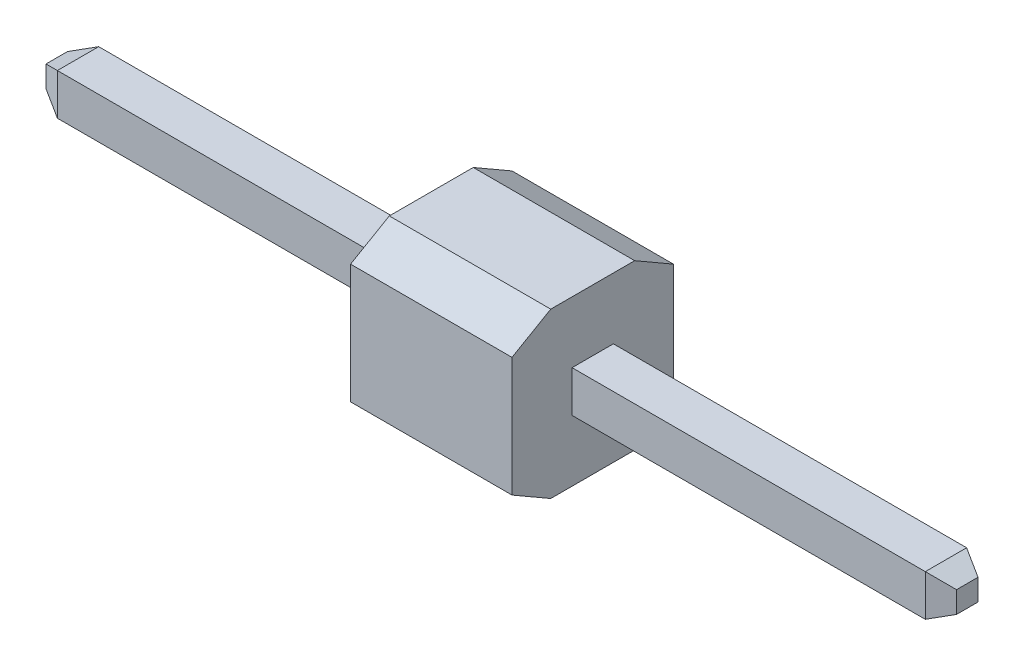
ISO-10303-21;
HEADER;
FILE_DESCRIPTION(('STEP AP214'),'2;1');
FILE_NAME('part.step','',(''),(''),'','','');
FILE_SCHEMA(('AUTOMOTIVE_DESIGN { 1 0 10303 214 1 1 1 1 }'));
ENDSEC;
DATA;
#1=APPLICATION_CONTEXT('core data for automotive mechanical design processes');
#2=APPLICATION_PROTOCOL_DEFINITION('international standard','automotive_design',2000,#1);
#3=PRODUCT_CONTEXT('',#1,'mechanical');
#4=PRODUCT('Part','Part','',(#3));
#5=PRODUCT_RELATED_PRODUCT_CATEGORY('part','',(#4));
#6=PRODUCT_DEFINITION_FORMATION('','',#4);
#7=PRODUCT_DEFINITION_CONTEXT('part definition',#1,'design');
#8=PRODUCT_DEFINITION('design','',#6,#7);
#9=PRODUCT_DEFINITION_SHAPE('','',#8);
#10=(LENGTH_UNIT() NAMED_UNIT(*) SI_UNIT(.MILLI.,.METRE.));
#11=(NAMED_UNIT(*) PLANE_ANGLE_UNIT() SI_UNIT($,.RADIAN.));
#12=(NAMED_UNIT(*) SI_UNIT($,.STERADIAN.) SOLID_ANGLE_UNIT());
#13=UNCERTAINTY_MEASURE_WITH_UNIT(LENGTH_MEASURE(1.E-05),#10,'distance_accuracy_value','');
#14=(GEOMETRIC_REPRESENTATION_CONTEXT(3) GLOBAL_UNCERTAINTY_ASSIGNED_CONTEXT((#13)) GLOBAL_UNIT_ASSIGNED_CONTEXT((#10,
#11,#12)) REPRESENTATION_CONTEXT('',''));
#15=CARTESIAN_POINT('',(0.,0.,0.));
#16=DIRECTION('',(0.,0.,1.));
#17=DIRECTION('',(1.,0.,0.));
#18=AXIS2_PLACEMENT_3D('',#15,#16,#17);
#19=CARTESIAN_POINT('',(5.42107439041138,-12.3828842739429,-2.7711194852955));
#20=DIRECTION('',(1.,-9.93476518829084E-08,4.37113882867379E-08));
#21=DIRECTION('',(-9.93476589883358E-08,-1.,8.74227765734759E-08));
#22=AXIS2_PLACEMENT_3D('',#19,#20,#21);
#23=PLANE('',#22);
#24=DIRECTION('',(-1.18186632778994E-08,-0.500000075710538,-0.866025360072935));
#25=VECTOR('',#24,1.);
#26=CARTESIAN_POINT('',(5.42107419823677,-13.6264739751751,-1.20111937657743));
#27=LINE('',#26,#25);
#28=CARTESIAN_POINT('',(5.42107419823677,-13.6264739751751,-1.20111937657743));
#29=VERTEX_POINT('',#28);
#30=CARTESIAN_POINT('',(5.42107419004856,-13.9728841891428,-1.80111934629329));
#31=VERTEX_POINT('',#30);
#32=EDGE_CURVE('E11',#29,#31,#27,.T.);
#33=ORIENTED_EDGE('',*,*,#32,.T.);
#34=DIRECTION('',(4.37113811813104E-08,-8.74227828590458E-08,-0.999999999999995));
#35=VECTOR('',#34,1.);
#36=CARTESIAN_POINT('',(5.42107419004856,-13.9728841891428,-1.80111934629329));
#37=LINE('',#36,#35);
#38=CARTESIAN_POINT('',(5.42107424687335,-13.9728843027924,-3.10111934629329));
#39=VERTEX_POINT('',#38);
#40=EDGE_CURVE('E304',#31,#39,#37,.T.);
#41=ORIENTED_EDGE('',*,*,#40,.T.);
#42=DIRECTION('',(8.75289963529269E-08,0.499999924289835,-0.866025447495714));
#43=VECTOR('',#42,1.);
#44=CARTESIAN_POINT('',(5.42107424687335,-13.9728843027924,-3.10111934629329));
#45=LINE('',#44,#43);
#46=CARTESIAN_POINT('',(5.42107430751522,-13.626474193732,-3.70111937657743));
#47=VERTEX_POINT('',#46);
#48=EDGE_CURVE('E296',#39,#47,#45,.T.);
#49=ORIENTED_EDGE('',*,*,#48,.T.);
#50=DIRECTION('',(9.93476593243698E-08,0.999999999999991,-8.74227764821842E-08));
#51=VECTOR('',#50,1.);
#52=CARTESIAN_POINT('',(5.42107430751522,-13.626474193732,-3.70111937657743));
#53=LINE('',#52,#51);
#54=CARTESIAN_POINT('',(5.4210744910282,-11.77929451676,-3.701119538063));
#55=VERTEX_POINT('',#54);
#56=EDGE_CURVE('E281',#47,#55,#53,.T.);
#57=ORIENTED_EDGE('',*,*,#56,.T.);
#58=DIRECTION('',(-1.18186632778994E-08,-0.500000075710538,-0.866025360072935));
#59=VECTOR('',#58,1.);
#60=CARTESIAN_POINT('',(5.42107449921641,-11.4328843027924,-3.10111956834714));
#61=LINE('',#60,#59);
#62=CARTESIAN_POINT('',(5.42107449921641,-11.4328843027924,-3.10111956834714));
#63=VERTEX_POINT('',#62);
#64=EDGE_CURVE('E265',#63,#55,#61,.T.);
#65=ORIENTED_EDGE('',*,*,#64,.F.);
#66=DIRECTION('',(4.37113811813104E-08,-8.74227842254741E-08,-0.999999999999995));
#67=VECTOR('',#66,1.);
#68=CARTESIAN_POINT('',(5.42107444239161,-11.4328841891428,-1.80111956834714));
#69=LINE('',#68,#67);
#70=CARTESIAN_POINT('',(5.42107444239161,-11.4328841891428,-1.80111956834714));
#71=VERTEX_POINT('',#70);
#72=EDGE_CURVE('E248',#71,#63,#69,.T.);
#73=ORIENTED_EDGE('',*,*,#72,.F.);
#74=DIRECTION('',(8.75289963529269E-08,0.499999924289835,-0.866025447495714));
#75=VECTOR('',#74,1.);
#76=CARTESIAN_POINT('',(5.42107438174975,-11.7792942982031,-1.201119538063));
#77=LINE('',#76,#75);
#78=CARTESIAN_POINT('',(5.42107438174975,-11.7792942982031,-1.201119538063));
#79=VERTEX_POINT('',#78);
#80=EDGE_CURVE('E242',#79,#71,#77,.T.);
#81=ORIENTED_EDGE('',*,*,#80,.F.);
#82=DIRECTION('',(9.93476593243698E-08,0.999999999999991,-8.74227762417695E-08));
#83=VECTOR('',#82,1.);
#84=CARTESIAN_POINT('',(5.42107419823677,-13.6264739751751,-1.20111937657743));
#85=LINE('',#84,#83);
#86=EDGE_CURVE('E236',#29,#79,#85,.T.);
#87=ORIENTED_EDGE('',*,*,#86,.F.);
#88=EDGE_LOOP('',(#33,#41,#49,#57,#65,#73,#81,#87));
#89=FACE_BOUND('',#88,.T.);
#90=DIRECTION('',(-4.37113803486431E-08,8.74227856773042E-08,0.999999999999995));
#91=VECTOR('',#90,1.);
#92=CARTESIAN_POINT('',(5.42107432682888,-13.0228842739429,-2.77111942934493));
#93=LINE('',#92,#91);
#94=CARTESIAN_POINT('',(5.42107432682888,-13.0228842739429,-2.77111942934493));
#95=VERTEX_POINT('',#94);
#96=CARTESIAN_POINT('',(5.42107429885359,-13.0228842179923,-2.13111942934493));
#97=VERTEX_POINT('',#96);
#98=EDGE_CURVE('E302',#95,#97,#93,.T.);
#99=ORIENTED_EDGE('',*,*,#98,.T.);
#100=DIRECTION('',(-9.93476578781121E-08,-0.999999999999991,8.7422776656742E-08));
#101=VECTOR('',#100,1.);
#102=CARTESIAN_POINT('',(5.42107436243609,-12.3828842179923,-2.1311194852955));
#103=LINE('',#102,#101);
#104=CARTESIAN_POINT('',(5.42107436243609,-12.3828842179923,-2.1311194852955));
#105=VERTEX_POINT('',#104);
#106=EDGE_CURVE('E293',#105,#97,#103,.T.);
#107=ORIENTED_EDGE('',*,*,#106,.F.);
#108=DIRECTION('',(-4.37113817364219E-08,8.74227829017466E-08,0.999999999999995));
#109=VECTOR('',#108,1.);
#110=CARTESIAN_POINT('',(5.42107439041138,-12.3828842739429,-2.7711194852955));
#111=LINE('',#110,#109);
#112=CARTESIAN_POINT('',(5.42107439041138,-12.3828842739429,-2.7711194852955));
#113=VERTEX_POINT('',#112);
#114=EDGE_CURVE('E278',#113,#105,#111,.T.);
#115=ORIENTED_EDGE('',*,*,#114,.F.);
#116=DIRECTION('',(-9.93476592658906E-08,-0.999999999999991,8.74227766567418E-08));
#117=VECTOR('',#116,1.);
#118=CARTESIAN_POINT('',(5.42107439041138,-12.3828842739429,-2.7711194852955));
#119=LINE('',#118,#117);
#120=EDGE_CURVE('E263',#113,#95,#119,.T.);
#121=ORIENTED_EDGE('',*,*,#120,.T.);
#122=EDGE_LOOP('',(#99,#107,#115,#121));
#123=FACE_BOUND('',#122,.T.);
#124=ADVANCED_FACE('F17',(#89,#123),#23,.T.);
#125=CARTESIAN_POINT('',(2.92107439041138,-12.3828840255737,-2.77111959457397));
#126=DIRECTION('',(1.,-9.93476518829084E-08,4.37113882867379E-08));
#127=DIRECTION('',(-9.93476589883358E-08,-1.,8.74227765734759E-08));
#128=AXIS2_PLACEMENT_3D('',#125,#126,#127);
#129=PLANE('',#128);
#130=DIRECTION('',(-1.18186626369119E-08,-0.500000075710538,-0.866025360072935));
#131=VECTOR('',#130,1.);
#132=CARTESIAN_POINT('',(2.92107419823677,-13.626473726806,-1.2011194858559));
#133=LINE('',#132,#131);
#134=CARTESIAN_POINT('',(2.92107419823677,-13.626473726806,-1.2011194858559));
#135=VERTEX_POINT('',#134);
#136=CARTESIAN_POINT('',(2.92107419004856,-13.9728839407736,-1.80111945557176));
#137=VERTEX_POINT('',#136);
#138=EDGE_CURVE('E24',#135,#137,#133,.T.);
#139=ORIENTED_EDGE('',*,*,#138,.F.);
#140=DIRECTION('',(9.9347659083955E-08,0.999999999999991,-8.74227762417695E-08));
#141=VECTOR('',#140,1.);
#142=CARTESIAN_POINT('',(2.92107419823677,-13.626473726806,-1.2011194858559));
#143=LINE('',#142,#141);
#144=CARTESIAN_POINT('',(2.92107438174975,-11.779294049834,-1.20111964734147));
#145=VERTEX_POINT('',#144);
#146=EDGE_CURVE('E300',#135,#145,#143,.T.);
#147=ORIENTED_EDGE('',*,*,#146,.T.);
#148=DIRECTION('',(8.75289957119393E-08,0.499999924289835,-0.866025447495714));
#149=VECTOR('',#148,1.);
#150=CARTESIAN_POINT('',(2.92107438174975,-11.779294049834,-1.20111964734147));
#151=LINE('',#150,#149);
#152=CARTESIAN_POINT('',(2.92107444239161,-11.4328839407736,-1.80111967762561));
#153=VERTEX_POINT('',#152);
#154=EDGE_CURVE('E286',#145,#153,#151,.T.);
#155=ORIENTED_EDGE('',*,*,#154,.T.);
#156=DIRECTION('',(4.37113811813104E-08,-8.74227842254741E-08,-0.999999999999995));
#157=VECTOR('',#156,1.);
#158=CARTESIAN_POINT('',(2.92107444239161,-11.4328839407736,-1.80111967762561));
#159=LINE('',#158,#157);
#160=CARTESIAN_POINT('',(2.92107449921641,-11.4328840544232,-3.10111967762561));
#161=VERTEX_POINT('',#160);
#162=EDGE_CURVE('E271',#153,#161,#159,.T.);
#163=ORIENTED_EDGE('',*,*,#162,.T.);
#164=DIRECTION('',(-1.18186626369119E-08,-0.500000075710538,-0.866025360072935));
#165=VECTOR('',#164,1.);
#166=CARTESIAN_POINT('',(2.92107449921641,-11.4328840544232,-3.10111967762561));
#167=LINE('',#166,#165);
#168=CARTESIAN_POINT('',(2.9210744910282,-11.7792942683909,-3.70111964734147));
#169=VERTEX_POINT('',#168);
#170=EDGE_CURVE('E253',#161,#169,#167,.T.);
#171=ORIENTED_EDGE('',*,*,#170,.T.);
#172=DIRECTION('',(9.9347659083955E-08,0.999999999999991,-8.74227764821842E-08));
#173=VECTOR('',#172,1.);
#174=CARTESIAN_POINT('',(2.92107430751522,-13.6264739453629,-3.7011194858559));
#175=LINE('',#174,#173);
#176=CARTESIAN_POINT('',(2.92107430751522,-13.6264739453629,-3.7011194858559));
#177=VERTEX_POINT('',#176);
#178=EDGE_CURVE('E261',#177,#169,#175,.T.);
#179=ORIENTED_EDGE('',*,*,#178,.F.);
#180=DIRECTION('',(8.75289957119394E-08,0.499999924289835,-0.866025447495714));
#181=VECTOR('',#180,1.);
#182=CARTESIAN_POINT('',(2.92107424687336,-13.9728840544232,-3.10111945557176));
#183=LINE('',#182,#181);
#184=CARTESIAN_POINT('',(2.92107424687336,-13.9728840544232,-3.10111945557176));
#185=VERTEX_POINT('',#184);
#186=EDGE_CURVE('E276',#185,#177,#183,.T.);
#187=ORIENTED_EDGE('',*,*,#186,.F.);
#188=DIRECTION('',(4.37113811813104E-08,-8.74227828590458E-08,-0.999999999999995));
#189=VECTOR('',#188,1.);
#190=CARTESIAN_POINT('',(2.92107419004856,-13.9728839407736,-1.80111945557176));
#191=LINE('',#190,#189);
#192=EDGE_CURVE('E291',#137,#185,#191,.T.);
#193=ORIENTED_EDGE('',*,*,#192,.F.);
#194=EDGE_LOOP('',(#139,#147,#155,#163,#171,#179,#187,#193));
#195=FACE_BOUND('',#194,.T.);
#196=DIRECTION('',(-9.93476592658908E-08,-0.999999999999991,8.7422776656742E-08));
#197=VECTOR('',#196,1.);
#198=CARTESIAN_POINT('',(2.92107436243609,-12.3828839696231,-2.13111959457397));
#199=LINE('',#198,#197);
#200=CARTESIAN_POINT('',(2.92107436243609,-12.3828839696231,-2.13111959457397));
#201=VERTEX_POINT('',#200);
#202=CARTESIAN_POINT('',(2.92107429885359,-13.0228839696231,-2.1311195386234));
#203=VERTEX_POINT('',#202);
#204=EDGE_CURVE('E298',#201,#203,#199,.T.);
#205=ORIENTED_EDGE('',*,*,#204,.T.);
#206=DIRECTION('',(-4.37113810425325E-08,8.74227856773042E-08,0.999999999999995));
#207=VECTOR('',#206,1.);
#208=CARTESIAN_POINT('',(2.92107432682888,-13.0228840255737,-2.7711195386234));
#209=LINE('',#208,#207);
#210=CARTESIAN_POINT('',(2.92107432682888,-13.0228840255737,-2.7711195386234));
#211=VERTEX_POINT('',#210);
#212=EDGE_CURVE('E283',#211,#203,#209,.T.);
#213=ORIENTED_EDGE('',*,*,#212,.F.);
#214=DIRECTION('',(-9.93476592658906E-08,-0.999999999999991,8.74227766567418E-08));
#215=VECTOR('',#214,1.);
#216=CARTESIAN_POINT('',(2.92107439041138,-12.3828840255737,-2.77111959457397));
#217=LINE('',#216,#215);
#218=CARTESIAN_POINT('',(2.92107439041138,-12.3828840255737,-2.77111959457397));
#219=VERTEX_POINT('',#218);
#220=EDGE_CURVE('E268',#219,#211,#217,.T.);
#221=ORIENTED_EDGE('',*,*,#220,.F.);
#222=DIRECTION('',(-4.37113810425325E-08,8.74227829017466E-08,0.999999999999995));
#223=VECTOR('',#222,1.);
#224=CARTESIAN_POINT('',(2.92107439041138,-12.3828840255737,-2.77111959457397));
#225=LINE('',#224,#223);
#226=EDGE_CURVE('E251',#219,#201,#225,.T.);
#227=ORIENTED_EDGE('',*,*,#226,.T.);
#228=EDGE_LOOP('',(#205,#213,#221,#227));
#229=FACE_BOUND('',#228,.T.);
#230=ADVANCED_FACE('F314',(#195,#229),#129,.F.);
#231=CARTESIAN_POINT('',(5.42107419823677,-13.6264739751751,-1.20111937657743));
#232=DIRECTION('',(1.07893287081065E-07,0.866025360072937,-0.500000075710535));
#233=DIRECTION('',(1.18186629566715E-08,0.500000075710542,0.866025360072941));
#234=AXIS2_PLACEMENT_3D('',#231,#232,#233);
#235=PLANE('',#234);
#236=ORIENTED_EDGE('',*,*,#138,.T.);
#237=DIRECTION('',(-0.999999999999994,9.93476518829078E-08,-4.37113884643734E-08));
#238=VECTOR('',#237,1.);
#239=CARTESIAN_POINT('',(5.42107419004856,-13.9728841891428,-1.80111934629329));
#240=LINE('',#239,#238);
#241=EDGE_CURVE('E288',#31,#137,#240,.T.);
#242=ORIENTED_EDGE('',*,*,#241,.F.);
#243=ORIENTED_EDGE('',*,*,#32,.F.);
#244=DIRECTION('',(-0.999999999999994,9.93476518829078E-08,-4.3711388109102E-08));
#245=VECTOR('',#244,1.);
#246=CARTESIAN_POINT('',(5.42107419823677,-13.6264739751751,-1.20111937657743));
#247=LINE('',#246,#245);
#248=EDGE_CURVE('E256',#29,#135,#247,.T.);
#249=ORIENTED_EDGE('',*,*,#248,.T.);
#250=EDGE_LOOP('',(#236,#242,#243,#249));
#251=FACE_BOUND('',#250,.T.);
#252=ADVANCED_FACE('F306',(#251),#235,.F.);
#253=CARTESIAN_POINT('',(5.42107419004856,-13.9728841891428,-1.80111934629329));
#254=DIRECTION('',(9.93476589883358E-08,1.,-8.74227765734759E-08));
#255=DIRECTION('',(1.,-9.93476518829084E-08,4.37113882867379E-08));
#256=AXIS2_PLACEMENT_3D('',#253,#254,#255);
#257=PLANE('',#256);
#258=ORIENTED_EDGE('',*,*,#192,.T.);
#259=DIRECTION('',(-0.999999999999994,9.93476518829078E-08,-4.37113882867377E-08));
#260=VECTOR('',#259,1.);
#261=CARTESIAN_POINT('',(5.42107424687335,-13.9728843027924,-3.10111934629329));
#262=LINE('',#261,#260);
#263=EDGE_CURVE('E273',#39,#185,#262,.T.);
#264=ORIENTED_EDGE('',*,*,#263,.F.);
#265=ORIENTED_EDGE('',*,*,#40,.F.);
#266=ORIENTED_EDGE('',*,*,#241,.T.);
#267=EDGE_LOOP('',(#258,#264,#265,#266));
#268=FACE_BOUND('',#267,.T.);
#269=ADVANCED_FACE('F311',(#268),#257,.F.);
#270=CARTESIAN_POINT('',(5.42107424687335,-13.9728843027924,-3.10111934629329));
#271=DIRECTION('',(6.41819058997377E-08,0.866025447495721,0.499999924289845));
#272=DIRECTION('',(-8.7528996031702E-08,-0.499999924289838,0.866025447495717));
#273=AXIS2_PLACEMENT_3D('',#270,#271,#272);
#274=PLANE('',#273);
#275=ORIENTED_EDGE('',*,*,#186,.T.);
#276=DIRECTION('',(-0.999999999999994,9.93476518829078E-08,-4.37113882867377E-08));
#277=VECTOR('',#276,1.);
#278=CARTESIAN_POINT('',(5.42107430751522,-13.626474193732,-3.70111937657743));
#279=LINE('',#278,#277);
#280=EDGE_CURVE('E258',#47,#177,#279,.T.);
#281=ORIENTED_EDGE('',*,*,#280,.F.);
#282=ORIENTED_EDGE('',*,*,#48,.F.);
#283=ORIENTED_EDGE('',*,*,#263,.T.);
#284=EDGE_LOOP('',(#275,#281,#282,#283));
#285=FACE_BOUND('',#284,.T.);
#286=ADVANCED_FACE('F319',(#285),#274,.F.);
#287=CARTESIAN_POINT('',(5.42107430751522,-13.626474193732,-3.70111937657743));
#288=DIRECTION('',(-4.37113811813106E-08,8.74227836789032E-08,1.));
#289=DIRECTION('',(-1.,9.93476518829084E-08,-4.37113882867379E-08));
#290=AXIS2_PLACEMENT_3D('',#287,#288,#289);
#291=PLANE('',#290);
#292=ORIENTED_EDGE('',*,*,#178,.T.);
#293=DIRECTION('',(-0.999999999999994,9.93476518829078E-08,-4.37113884643734E-08));
#294=VECTOR('',#293,1.);
#295=CARTESIAN_POINT('',(5.4210744910282,-11.77929451676,-3.701119538063));
#296=LINE('',#295,#294);
#297=EDGE_CURVE('E245',#55,#169,#296,.T.);
#298=ORIENTED_EDGE('',*,*,#297,.F.);
#299=ORIENTED_EDGE('',*,*,#56,.F.);
#300=ORIENTED_EDGE('',*,*,#280,.T.);
#301=EDGE_LOOP('',(#292,#298,#299,#300));
#302=FACE_BOUND('',#301,.T.);
#303=ADVANCED_FACE('F326',(#302),#291,.F.);
#304=CARTESIAN_POINT('',(5.42107449921641,-11.4328843027924,-3.10111956834714));
#305=DIRECTION('',(1.07893287081065E-07,0.866025360072937,-0.500000075710535));
#306=DIRECTION('',(1.18186629566715E-08,0.500000075710542,0.866025360072941));
#307=AXIS2_PLACEMENT_3D('',#304,#305,#306);
#308=PLANE('',#307);
#309=ORIENTED_EDGE('',*,*,#170,.F.);
#310=DIRECTION('',(-0.999999999999994,9.93476518829078E-08,-4.37113882867377E-08));
#311=VECTOR('',#310,1.);
#312=CARTESIAN_POINT('',(5.42107449921641,-11.4328843027924,-3.10111956834714));
#313=LINE('',#312,#311);
#314=EDGE_CURVE('E239',#63,#161,#313,.T.);
#315=ORIENTED_EDGE('',*,*,#314,.F.);
#316=ORIENTED_EDGE('',*,*,#64,.T.);
#317=ORIENTED_EDGE('',*,*,#297,.T.);
#318=EDGE_LOOP('',(#309,#315,#316,#317));
#319=FACE_BOUND('',#318,.T.);
#320=ADVANCED_FACE('F329',(#319),#308,.T.);
#321=CARTESIAN_POINT('',(5.42107444239161,-11.4328841891428,-1.80111956834714));
#322=DIRECTION('',(9.93476589883358E-08,1.,-8.74227765734759E-08));
#323=DIRECTION('',(1.,-9.93476518829084E-08,4.37113882867379E-08));
#324=AXIS2_PLACEMENT_3D('',#321,#322,#323);
#325=PLANE('',#324);
#326=ORIENTED_EDGE('',*,*,#162,.F.);
#327=DIRECTION('',(-0.999999999999994,9.93476518829078E-08,-4.37113883755555E-08));
#328=VECTOR('',#327,1.);
#329=CARTESIAN_POINT('',(5.42107444239161,-11.4328841891428,-1.80111956834714));
#330=LINE('',#329,#328);
#331=EDGE_CURVE('E233',#71,#153,#330,.T.);
#332=ORIENTED_EDGE('',*,*,#331,.F.);
#333=ORIENTED_EDGE('',*,*,#72,.T.);
#334=ORIENTED_EDGE('',*,*,#314,.T.);
#335=EDGE_LOOP('',(#326,#332,#333,#334));
#336=FACE_BOUND('',#335,.T.);
#337=ADVANCED_FACE('F333',(#336),#325,.T.);
#338=CARTESIAN_POINT('',(5.42107438174975,-11.7792942982031,-1.201119538063));
#339=DIRECTION('',(6.41819058997377E-08,0.866025447495721,0.499999924289845));
#340=DIRECTION('',(-8.7528996031702E-08,-0.499999924289838,0.866025447495717));
#341=AXIS2_PLACEMENT_3D('',#338,#339,#340);
#342=PLANE('',#341);
#343=ORIENTED_EDGE('',*,*,#154,.F.);
#344=DIRECTION('',(-0.999999999999994,9.93476518829078E-08,-4.3711388109102E-08));
#345=VECTOR('',#344,1.);
#346=CARTESIAN_POINT('',(5.42107438174975,-11.7792942982031,-1.201119538063));
#347=LINE('',#346,#345);
#348=EDGE_CURVE('E230',#79,#145,#347,.T.);
#349=ORIENTED_EDGE('',*,*,#348,.F.);
#350=ORIENTED_EDGE('',*,*,#80,.T.);
#351=ORIENTED_EDGE('',*,*,#331,.T.);
#352=EDGE_LOOP('',(#343,#349,#350,#351));
#353=FACE_BOUND('',#352,.T.);
#354=ADVANCED_FACE('F337',(#353),#342,.T.);
#355=CARTESIAN_POINT('',(5.42107419823677,-13.6264739751751,-1.20111937657743));
#356=DIRECTION('',(-4.37113811813106E-08,8.74227835615132E-08,1.));
#357=DIRECTION('',(-9.93476589883358E-08,-1.,8.74227764560859E-08));
#358=AXIS2_PLACEMENT_3D('',#355,#356,#357);
#359=PLANE('',#358);
#360=ORIENTED_EDGE('',*,*,#146,.F.);
#361=ORIENTED_EDGE('',*,*,#248,.F.);
#362=ORIENTED_EDGE('',*,*,#86,.T.);
#363=ORIENTED_EDGE('',*,*,#348,.T.);
#364=EDGE_LOOP('',(#360,#361,#362,#363));
#365=FACE_BOUND('',#364,.T.);
#366=ADVANCED_FACE('F339',(#365),#359,.T.);
#367=CARTESIAN_POINT('',(-2.87892560958862,-12.3828834493573,-2.77111984810003));
#368=DIRECTION('',(-1.,9.93476518829084E-08,-4.37113882867379E-08));
#369=DIRECTION('',(9.93476589883358E-08,1.,-8.74227765734759E-08));
#370=AXIS2_PLACEMENT_3D('',#367,#368,#369);
#371=PLANE('',#370);
#372=DIRECTION('',(9.9347663492056E-08,0.999999999999991,-8.74227774760709E-08));
#373=VECTOR('',#372,1.);
#374=CARTESIAN_POINT('',(-2.87892567913227,-12.8690018796685,-2.2850013327932));
#375=LINE('',#374,#373);
#376=CARTESIAN_POINT('',(-2.87892567913226,-12.8690018796685,-2.2850013327932));
#377=VERTEX_POINT('',#376);
#378=CARTESIAN_POINT('',(-2.8789256461253,-12.5367649340505,-2.28500136183828));
#379=VERTEX_POINT('',#378);
#380=EDGE_CURVE('E228',#377,#379,#375,.T.);
#381=ORIENTED_EDGE('',*,*,#380,.T.);
#382=DIRECTION('',(4.37113820547149E-08,-8.74227801493995E-08,-0.999999999999995));
#383=VECTOR('',#382,1.);
#384=CARTESIAN_POINT('',(-2.8789256461253,-12.5367649340505,-2.28500136183828));
#385=LINE('',#384,#383);
#386=CARTESIAN_POINT('',(-2.87892563160277,-12.5367649630956,-2.61723830745628));
#387=VERTEX_POINT('',#386);
#388=EDGE_CURVE('E223',#379,#387,#385,.T.);
#389=ORIENTED_EDGE('',*,*,#388,.T.);
#390=DIRECTION('',(-9.93476554720712E-08,-0.999999999999991,8.74227761394067E-08));
#391=VECTOR('',#390,1.);
#392=CARTESIAN_POINT('',(-2.87892563160277,-12.5367649630956,-2.61723830745628));
#393=LINE('',#392,#391);
#394=CARTESIAN_POINT('',(-2.87892566460973,-12.8690019087136,-2.6172382784112));
#395=VERTEX_POINT('',#394);
#396=EDGE_CURVE('E215',#387,#395,#393,.T.);
#397=ORIENTED_EDGE('',*,*,#396,.T.);
#398=DIRECTION('',(-4.37113740347301E-08,8.74227801493995E-08,0.999999999999995));
#399=VECTOR('',#398,1.);
#400=CARTESIAN_POINT('',(-2.87892566460973,-12.8690019087136,-2.6172382784112));
#401=LINE('',#400,#399);
#402=EDGE_CURVE('E207',#395,#377,#401,.T.);
#403=ORIENTED_EDGE('',*,*,#402,.T.);
#404=EDGE_LOOP('',(#381,#389,#397,#403));
#405=FACE_BOUND('',#404,.T.);
#406=ADVANCED_FACE('F341',(#405),#371,.T.);
#407=CARTESIAN_POINT('',(-2.87892560958862,-12.3828834493573,-2.77111984810003));
#408=DIRECTION('',(9.93476589883358E-08,1.,-8.74227764510112E-08));
#409=DIRECTION('',(-4.37113811813106E-08,8.74227835564385E-08,1.));
#410=AXIS2_PLACEMENT_3D('',#407,#408,#409);
#411=PLANE('',#410);
#412=DIRECTION('',(0.999999999999994,-9.93476517789893E-08,4.37113882769953E-08));
#413=VECTOR('',#412,1.);
#414=CARTESIAN_POINT('',(-2.54892560958862,-12.3828834821421,-2.77111983367527));
#415=LINE('',#414,#413);
#416=CARTESIAN_POINT('',(-2.54892560958862,-12.3828834821421,-2.77111983367527));
#417=VERTEX_POINT('',#416);
#418=EDGE_CURVE('E225',#417,#219,#415,.T.);
#419=ORIENTED_EDGE('',*,*,#418,.F.);
#420=DIRECTION('',(-4.37113817364219E-08,8.74227856773042E-08,0.999999999999995));
#421=VECTOR('',#420,1.);
#422=CARTESIAN_POINT('',(-2.54892560958862,-12.3828834821421,-2.77111983367527));
#423=LINE('',#422,#421);
#424=CARTESIAN_POINT('',(-2.54892563756391,-12.3828834261915,-2.13111983367527));
#425=VERTEX_POINT('',#424);
#426=EDGE_CURVE('E217',#417,#425,#423,.T.);
#427=ORIENTED_EDGE('',*,*,#426,.T.);
#428=DIRECTION('',(0.999999999999994,-9.93476521037346E-08,4.3711388195809E-08));
#429=VECTOR('',#428,1.);
#430=CARTESIAN_POINT('',(-2.54892563756391,-12.3828834261915,-2.13111983367527));
#431=LINE('',#430,#429);
#432=EDGE_CURVE('E220',#425,#201,#431,.T.);
#433=ORIENTED_EDGE('',*,*,#432,.T.);
#434=ORIENTED_EDGE('',*,*,#226,.F.);
#435=EDGE_LOOP('',(#419,#427,#433,#434));
#436=FACE_BOUND('',#435,.T.);
#437=ADVANCED_FACE('F348',(#436),#411,.T.);
#438=CARTESIAN_POINT('',(-2.87892563756391,-12.3828833934068,-2.13111984810003));
#439=DIRECTION('',(-4.37113811813106E-08,8.74227836789032E-08,1.));
#440=DIRECTION('',(-1.,9.93476518829084E-08,-4.37113882867379E-08));
#441=AXIS2_PLACEMENT_3D('',#438,#439,#440);
#442=PLANE('',#441);
#443=ORIENTED_EDGE('',*,*,#432,.F.);
#444=DIRECTION('',(-9.93476578781118E-08,-0.999999999999991,8.74227766567418E-08));
#445=VECTOR('',#444,1.);
#446=CARTESIAN_POINT('',(-2.54892563756391,-12.3828834261915,-2.13111983367527));
#447=LINE('',#446,#445);
#448=CARTESIAN_POINT('',(-2.54892570114641,-13.0228834261915,-2.13111977772469));
#449=VERTEX_POINT('',#448);
#450=EDGE_CURVE('E209',#425,#449,#447,.T.);
#451=ORIENTED_EDGE('',*,*,#450,.T.);
#452=DIRECTION('',(0.999999999999994,-9.93476517789893E-08,4.3711388195809E-08));
#453=VECTOR('',#452,1.);
#454=CARTESIAN_POINT('',(-2.54892570114641,-13.0228834261915,-2.13111977772469));
#455=LINE('',#454,#453);
#456=EDGE_CURVE('E212',#449,#203,#455,.T.);
#457=ORIENTED_EDGE('',*,*,#456,.T.);
#458=ORIENTED_EDGE('',*,*,#204,.F.);
#459=EDGE_LOOP('',(#443,#451,#457,#458));
#460=FACE_BOUND('',#459,.T.);
#461=ADVANCED_FACE('F424',(#460),#442,.T.);
#462=CARTESIAN_POINT('',(-2.87892567317112,-13.0228834493574,-2.77111979214945));
#463=DIRECTION('',(9.93476589883357E-08,1.,-8.74227764040693E-08));
#464=DIRECTION('',(-4.37113811813106E-08,8.74227835094966E-08,1.));
#465=AXIS2_PLACEMENT_3D('',#462,#463,#464);
#466=PLANE('',#465);
#467=ORIENTED_EDGE('',*,*,#456,.F.);
#468=DIRECTION('',(4.37113817364219E-08,-8.74227829017466E-08,-0.999999999999995));
#469=VECTOR('',#468,1.);
#470=CARTESIAN_POINT('',(-2.54892570114641,-13.0228834261915,-2.13111977772469));
#471=LINE('',#470,#469);
#472=CARTESIAN_POINT('',(-2.54892567317112,-13.0228834821421,-2.77111977772469));
#473=VERTEX_POINT('',#472);
#474=EDGE_CURVE('E201',#449,#473,#471,.T.);
#475=ORIENTED_EDGE('',*,*,#474,.T.);
#476=DIRECTION('',(0.999999999999994,-9.93476521037346E-08,4.37113882769953E-08));
#477=VECTOR('',#476,1.);
#478=CARTESIAN_POINT('',(-2.54892567317112,-13.0228834821421,-2.77111977772469));
#479=LINE('',#478,#477);
#480=EDGE_CURVE('E204',#473,#211,#479,.T.);
#481=ORIENTED_EDGE('',*,*,#480,.T.);
#482=ORIENTED_EDGE('',*,*,#212,.T.);
#483=EDGE_LOOP('',(#467,#475,#481,#482));
#484=FACE_BOUND('',#483,.T.);
#485=ADVANCED_FACE('F421',(#484),#466,.F.);
#486=CARTESIAN_POINT('',(-2.87892560958862,-12.3828834493573,-2.77111984810003));
#487=DIRECTION('',(-4.37113811813106E-08,8.74227836789032E-08,1.));
#488=DIRECTION('',(-1.,9.93476518829084E-08,-4.37113882867379E-08));
#489=AXIS2_PLACEMENT_3D('',#486,#487,#488);
#490=PLANE('',#489);
#491=ORIENTED_EDGE('',*,*,#480,.F.);
#492=DIRECTION('',(9.93476606536696E-08,0.999999999999991,-8.7422776656742E-08));
#493=VECTOR('',#492,1.);
#494=CARTESIAN_POINT('',(-2.54892567317113,-13.0228834821421,-2.77111977772469));
#495=LINE('',#494,#493);
#496=EDGE_CURVE('E196',#473,#417,#495,.T.);
#497=ORIENTED_EDGE('',*,*,#496,.T.);
#498=ORIENTED_EDGE('',*,*,#418,.T.);
#499=ORIENTED_EDGE('',*,*,#220,.T.);
#500=EDGE_LOOP('',(#491,#497,#498,#499));
#501=FACE_BOUND('',#500,.T.);
#502=ADVANCED_FACE('F376',(#501),#490,.F.);
#503=CARTESIAN_POINT('',(-2.87892560958862,-12.3828834493573,-2.77111984810003));
#504=DIRECTION('',(-4.37113811813106E-08,8.74227836789032E-08,1.));
#505=DIRECTION('',(-1.,9.93476518829084E-08,-4.37113882867379E-08));
#506=AXIS2_PLACEMENT_3D('',#503,#504,#505);
#507=PLANE('',#506);
#508=DIRECTION('',(0.999999999999994,-9.93476517789893E-08,4.37113882769953E-08));
#509=VECTOR('',#508,1.);
#510=CARTESIAN_POINT('',(5.42107439041138,-12.3828842739429,-2.7711194852955));
#511=LINE('',#510,#509);
#512=CARTESIAN_POINT('',(10.8910743904114,-12.3828848173745,-2.77111924619421));
#513=VERTEX_POINT('',#512);
#514=EDGE_CURVE('E199',#113,#513,#511,.T.);
#515=ORIENTED_EDGE('',*,*,#514,.T.);
#516=DIRECTION('',(-9.93476578781118E-08,-0.999999999999991,8.74227766567418E-08));
#517=VECTOR('',#516,1.);
#518=CARTESIAN_POINT('',(10.8910743904114,-12.3828848173745,-2.77111924619421));
#519=LINE('',#518,#517);
#520=CARTESIAN_POINT('',(10.8910743268289,-13.0228848173745,-2.77111919024363));
#521=VERTEX_POINT('',#520);
#522=EDGE_CURVE('E191',#513,#521,#519,.T.);
#523=ORIENTED_EDGE('',*,*,#522,.T.);
#524=DIRECTION('',(0.999999999999994,-9.9347651454244E-08,4.37113882769953E-08));
#525=VECTOR('',#524,1.);
#526=CARTESIAN_POINT('',(5.42107432682888,-13.0228842739429,-2.77111942934493));
#527=LINE('',#526,#525);
#528=EDGE_CURVE('E194',#95,#521,#527,.T.);
#529=ORIENTED_EDGE('',*,*,#528,.F.);
#530=ORIENTED_EDGE('',*,*,#120,.F.);
#531=EDGE_LOOP('',(#515,#523,#529,#530));
#532=FACE_BOUND('',#531,.T.);
#533=ADVANCED_FACE('F367',(#532),#507,.F.);
#534=CARTESIAN_POINT('',(-2.87892567317112,-13.0228834493574,-2.77111979214945));
#535=DIRECTION('',(9.93476589883357E-08,1.,-8.74227764040693E-08));
#536=DIRECTION('',(-4.37113811813106E-08,8.74227835094966E-08,1.));
#537=AXIS2_PLACEMENT_3D('',#534,#535,#536);
#538=PLANE('',#537);
#539=ORIENTED_EDGE('',*,*,#528,.T.);
#540=DIRECTION('',(-4.37113817364219E-08,8.74227829017466E-08,0.999999999999995));
#541=VECTOR('',#540,1.);
#542=CARTESIAN_POINT('',(10.8910743268289,-13.0228848173745,-2.77111919024363));
#543=LINE('',#542,#541);
#544=CARTESIAN_POINT('',(10.8910742988536,-13.0228847614239,-2.13111919024363));
#545=VERTEX_POINT('',#544);
#546=EDGE_CURVE('E186',#521,#545,#543,.T.);
#547=ORIENTED_EDGE('',*,*,#546,.T.);
#548=DIRECTION('',(0.999999999999994,-9.93476517789893E-08,4.37113881146227E-08));
#549=VECTOR('',#548,1.);
#550=CARTESIAN_POINT('',(5.42107429885359,-13.0228842179923,-2.13111942934493));
#551=LINE('',#550,#549);
#552=EDGE_CURVE('E189',#97,#545,#551,.T.);
#553=ORIENTED_EDGE('',*,*,#552,.F.);
#554=ORIENTED_EDGE('',*,*,#98,.F.);
#555=EDGE_LOOP('',(#539,#547,#553,#554));
#556=FACE_BOUND('',#555,.T.);
#557=ADVANCED_FACE('F364',(#556),#538,.F.);
#558=CARTESIAN_POINT('',(-2.87892563756391,-12.3828833934068,-2.13111984810003));
#559=DIRECTION('',(-4.37113811813106E-08,8.74227836789032E-08,1.));
#560=DIRECTION('',(-1.,9.93476518829084E-08,-4.37113882867379E-08));
#561=AXIS2_PLACEMENT_3D('',#558,#559,#560);
#562=PLANE('',#561);
#563=ORIENTED_EDGE('',*,*,#552,.T.);
#564=DIRECTION('',(9.93476578781118E-08,0.999999999999991,-8.74227759628524E-08));
#565=VECTOR('',#564,1.);
#566=CARTESIAN_POINT('',(10.8910742988536,-13.0228847614239,-2.13111919024363));
#567=LINE('',#566,#565);
#568=CARTESIAN_POINT('',(10.8910743624361,-12.3828847614239,-2.13111924619421));
#569=VERTEX_POINT('',#568);
#570=EDGE_CURVE('E176',#545,#569,#567,.T.);
#571=ORIENTED_EDGE('',*,*,#570,.T.);
#572=DIRECTION('',(0.999999999999994,-9.93476517789893E-08,4.37113881146227E-08));
#573=VECTOR('',#572,1.);
#574=CARTESIAN_POINT('',(5.42107436243609,-12.3828842179923,-2.1311194852955));
#575=LINE('',#574,#573);
#576=EDGE_CURVE('E179',#105,#569,#575,.T.);
#577=ORIENTED_EDGE('',*,*,#576,.F.);
#578=ORIENTED_EDGE('',*,*,#106,.T.);
#579=EDGE_LOOP('',(#563,#571,#577,#578));
#580=FACE_BOUND('',#579,.T.);
#581=ADVANCED_FACE('F366',(#580),#562,.T.);
#582=CARTESIAN_POINT('',(-2.87892560958862,-12.3828834493573,-2.77111984810003));
#583=DIRECTION('',(9.93476589883358E-08,1.,-8.74227764510112E-08));
#584=DIRECTION('',(-4.37113811813106E-08,8.74227835564385E-08,1.));
#585=AXIS2_PLACEMENT_3D('',#582,#583,#584);
#586=PLANE('',#585);
#587=ORIENTED_EDGE('',*,*,#576,.T.);
#588=DIRECTION('',(4.37113789608643E-08,-8.74227829017466E-08,-0.999999999999995));
#589=VECTOR('',#588,1.);
#590=CARTESIAN_POINT('',(10.8910743624361,-12.3828847614239,-2.13111924619421));
#591=LINE('',#590,#589);
#592=EDGE_CURVE('E167',#569,#513,#591,.T.);
#593=ORIENTED_EDGE('',*,*,#592,.T.);
#594=ORIENTED_EDGE('',*,*,#514,.F.);
#595=ORIENTED_EDGE('',*,*,#114,.T.);
#596=EDGE_LOOP('',(#587,#593,#594,#595));
#597=FACE_BOUND('',#596,.T.);
#598=ADVANCED_FACE('F373',(#597),#586,.T.);
#599=CARTESIAN_POINT('',(11.2210743904114,-12.3828848501592,-2.77111923176945));
#600=DIRECTION('',(-1.,9.93476518829084E-08,-4.37113882867379E-08));
#601=DIRECTION('',(9.93476589883358E-08,1.,-8.74227765734759E-08));
#602=AXIS2_PLACEMENT_3D('',#599,#600,#601);
#603=PLANE('',#602);
#604=DIRECTION('',(-9.9347663492056E-08,-0.999999999999991,8.74227761394067E-08));
#605=VECTOR('',#604,1.);
#606=CARTESIAN_POINT('',(11.2210743538747,-12.5367663348524,-2.2850007455077));
#607=LINE('',#606,#605);
#608=CARTESIAN_POINT('',(11.2210743538747,-12.5367663348524,-2.2850007455077));
#609=VERTEX_POINT('',#608);
#610=CARTESIAN_POINT('',(11.2210743208677,-12.8690032804704,-2.28500071646263));
#611=VERTEX_POINT('',#610);
#612=EDGE_CURVE('E153',#609,#611,#607,.T.);
#613=ORIENTED_EDGE('',*,*,#612,.T.);
#614=DIRECTION('',(4.37113820547149E-08,-8.74227854960561E-08,-0.999999999999995));
#615=VECTOR('',#614,1.);
#616=CARTESIAN_POINT('',(11.2210743208677,-12.8690032804704,-2.28500071646263));
#617=LINE('',#616,#615);
#618=CARTESIAN_POINT('',(11.2210743353903,-12.8690033095155,-2.61723766208063));
#619=VERTEX_POINT('',#618);
#620=EDGE_CURVE('E395',#611,#619,#617,.T.);
#621=ORIENTED_EDGE('',*,*,#620,.T.);
#622=DIRECTION('',(9.93476527987429E-08,0.999999999999991,-8.74227761394067E-08));
#623=VECTOR('',#622,1.);
#624=CARTESIAN_POINT('',(11.2210743353903,-12.8690033095155,-2.61723766208063));
#625=LINE('',#624,#623);
#626=CARTESIAN_POINT('',(11.2210743683972,-12.5367663638975,-2.6172376911257));
#627=VERTEX_POINT('',#626);
#628=EDGE_CURVE('E156',#619,#627,#625,.T.);
#629=ORIENTED_EDGE('',*,*,#628,.T.);
#630=DIRECTION('',(-4.37113874013715E-08,8.74227854960561E-08,0.999999999999995));
#631=VECTOR('',#630,1.);
#632=CARTESIAN_POINT('',(11.2210743683972,-12.5367663638975,-2.6172376911257));
#633=LINE('',#632,#631);
#634=EDGE_CURVE('E149',#627,#609,#633,.T.);
#635=ORIENTED_EDGE('',*,*,#634,.T.);
#636=EDGE_LOOP('',(#613,#621,#629,#635));
#637=FACE_BOUND('',#636,.T.);
#638=ADVANCED_FACE('F151',(#637),#603,.F.);
#639=CARTESIAN_POINT('',(-2.87892565788336,-12.8690019221663,-2.7711198056022));
#640=DIRECTION('',(-0.422618351780369,-0.906307745050466,6.07587120833484E-08));
#641=DIRECTION('',(4.37113811813106E-08,-8.74227835094966E-08,-1.));
#642=AXIS2_PLACEMENT_3D('',#639,#640,#641);
#643=PLANE('',#642);
#644=DIRECTION('',(0.834817073788748,-0.389281669540043,0.389281691158098));
#645=VECTOR('',#644,1.);
#646=CARTESIAN_POINT('',(-2.87892567913196,-12.8690018796682,-2.28500133279353));
#647=LINE('',#646,#645);
#648=EDGE_CURVE('E181',#377,#449,#647,.T.);
#649=ORIENTED_EDGE('',*,*,#648,.F.);
#650=ORIENTED_EDGE('',*,*,#402,.F.);
#651=DIRECTION('',(-0.834817107820822,0.389281737604206,0.389281550111905));
#652=VECTOR('',#651,1.);
#653=CARTESIAN_POINT('',(-2.54892567317091,-13.0228834821418,-2.77111977772446));
#654=LINE('',#653,#652);
#655=EDGE_CURVE('E404',#473,#395,#654,.T.);
#656=ORIENTED_EDGE('',*,*,#655,.F.);
#657=ORIENTED_EDGE('',*,*,#474,.F.);
#658=EDGE_LOOP('',(#649,#650,#656,#657));
#659=FACE_BOUND('',#658,.T.);
#660=ADVANCED_FACE('F418',(#659),#643,.T.);
#661=CARTESIAN_POINT('',(-2.878925616315,-12.3828834359046,-2.61723832090903));
#662=DIRECTION('',(-0.422618222124847,-3.72458176658199E-08,-0.906307805509828));
#663=DIRECTION('',(9.93476589883358E-08,1.,-8.74227765734759E-08));
#664=AXIS2_PLACEMENT_3D('',#661,#662,#663);
#665=PLANE('',#664);
#666=ORIENTED_EDGE('',*,*,#655,.T.);
#667=ORIENTED_EDGE('',*,*,#396,.F.);
#668=DIRECTION('',(-0.834817185169256,-0.389281503665796,0.389281618176066));
#669=VECTOR('',#668,1.);
#670=CARTESIAN_POINT('',(-2.54892560958845,-12.3828834821423,-2.77111983367508));
#671=LINE('',#670,#669);
#672=EDGE_CURVE('E160',#417,#387,#671,.T.);
#673=ORIENTED_EDGE('',*,*,#672,.F.);
#674=ORIENTED_EDGE('',*,*,#496,.F.);
#675=EDGE_LOOP('',(#666,#667,#673,#674));
#676=FACE_BOUND('',#675,.T.);
#677=ADVANCED_FACE('F434',(#676),#665,.T.);
#678=CARTESIAN_POINT('',(-2.54892563756391,-12.3828834261915,-2.13111983367527));
#679=DIRECTION('',(0.422618301356777,-1.21218081559392E-07,-0.906307768563367));
#680=DIRECTION('',(-9.93476589883358E-08,-1.,8.74227765734759E-08));
#681=AXIS2_PLACEMENT_3D('',#678,#679,#680);
#682=PLANE('',#681);
#683=ORIENTED_EDGE('',*,*,#648,.T.);
#684=ORIENTED_EDGE('',*,*,#450,.F.);
#685=DIRECTION('',(0.834817151137182,0.389281571729962,0.389281623093936));
#686=VECTOR('',#685,1.);
#687=CARTESIAN_POINT('',(-2.87892564612521,-12.5367649340506,-2.28500136183837));
#688=LINE('',#687,#686);
#689=EDGE_CURVE('E170',#379,#425,#688,.T.);
#690=ORIENTED_EDGE('',*,*,#689,.F.);
#691=ORIENTED_EDGE('',*,*,#380,.F.);
#692=EDGE_LOOP('',(#683,#684,#690,#691));
#693=FACE_BOUND('',#692,.T.);
#694=ADVANCED_FACE('F413',(#693),#682,.F.);
#695=CARTESIAN_POINT('',(-2.54892560958862,-12.3828834821421,-2.77111983367527));
#696=DIRECTION('',(0.422618171701255,-0.906307829022729,9.770517399793E-08));
#697=DIRECTION('',(-4.37113811813106E-08,8.74227835564385E-08,1.));
#698=AXIS2_PLACEMENT_3D('',#695,#696,#697);
#699=PLANE('',#698);
#700=ORIENTED_EDGE('',*,*,#672,.T.);
#701=ORIENTED_EDGE('',*,*,#388,.F.);
#702=ORIENTED_EDGE('',*,*,#689,.T.);
#703=ORIENTED_EDGE('',*,*,#426,.F.);
#704=EDGE_LOOP('',(#700,#701,#702,#703));
#705=FACE_BOUND('',#704,.T.);
#706=ADVANCED_FACE('F429',(#705),#699,.F.);
#707=CARTESIAN_POINT('',(11.2210743751236,-12.5367663773502,-2.7711192183167));
#708=DIRECTION('',(0.422618351780369,0.906307745050466,-6.07587121258922E-08));
#709=DIRECTION('',(4.37113811813106E-08,-8.74227835564385E-08,-1.));
#710=AXIS2_PLACEMENT_3D('',#707,#708,#709);
#711=PLANE('',#710);
#712=DIRECTION('',(-0.834817107820822,0.389281737604209,0.389281550111904));
#713=VECTOR('',#712,1.);
#714=CARTESIAN_POINT('',(11.2210743538744,-12.5367663348527,-2.28500074550803));
#715=LINE('',#714,#713);
#716=EDGE_CURVE('E164',#609,#569,#715,.T.);
#717=ORIENTED_EDGE('',*,*,#716,.F.);
#718=ORIENTED_EDGE('',*,*,#634,.F.);
#719=DIRECTION('',(0.83481707378875,-0.389281669540041,0.389281691158096));
#720=VECTOR('',#719,1.);
#721=CARTESIAN_POINT('',(10.8910743904114,-12.3828848173745,-2.77111924619421));
#722=LINE('',#721,#720);
#723=EDGE_CURVE('E392',#513,#627,#722,.T.);
#724=ORIENTED_EDGE('',*,*,#723,.F.);
#725=ORIENTED_EDGE('',*,*,#592,.F.);
#726=EDGE_LOOP('',(#717,#718,#724,#725));
#727=FACE_BOUND('',#726,.T.);
#728=ADVANCED_FACE('F165',(#727),#711,.T.);
#729=CARTESIAN_POINT('',(10.8910743904114,-12.3828848173745,-2.77111924619421));
#730=DIRECTION('',(-0.422618301356777,1.21218081559392E-07,0.906307768563367));
#731=DIRECTION('',(-9.93476589883358E-08,-1.,8.74227765734759E-08));
#732=AXIS2_PLACEMENT_3D('',#729,#730,#731);
#733=PLANE('',#732);
#734=ORIENTED_EDGE('',*,*,#723,.T.);
#735=ORIENTED_EDGE('',*,*,#628,.F.);
#736=DIRECTION('',(0.83481715113718,0.389281571729965,0.389281623093937));
#737=VECTOR('',#736,1.);
#738=CARTESIAN_POINT('',(10.8910743268288,-13.0228848173745,-2.77111919024349));
#739=LINE('',#738,#737);
#740=EDGE_CURVE('E389',#521,#619,#739,.T.);
#741=ORIENTED_EDGE('',*,*,#740,.F.);
#742=ORIENTED_EDGE('',*,*,#522,.F.);
#743=EDGE_LOOP('',(#734,#735,#741,#742));
#744=FACE_BOUND('',#743,.T.);
#745=ADVANCED_FACE('F390',(#744),#733,.F.);
#746=CARTESIAN_POINT('',(11.2210743691625,-12.3828848076614,-2.28500075896045));
#747=DIRECTION('',(0.422618222124847,3.72458176658199E-08,0.906307805509828));
#748=DIRECTION('',(9.93476589883358E-08,1.,-8.74227765734759E-08));
#749=AXIS2_PLACEMENT_3D('',#746,#747,#748);
#750=PLANE('',#749);
#751=ORIENTED_EDGE('',*,*,#716,.T.);
#752=ORIENTED_EDGE('',*,*,#570,.F.);
#753=DIRECTION('',(-0.834817185169257,-0.389281503665794,0.389281618176066));
#754=VECTOR('',#753,1.);
#755=CARTESIAN_POINT('',(11.2210743208674,-12.8690032804701,-2.28500071646296));
#756=LINE('',#755,#754);
#757=EDGE_CURVE('E175',#611,#545,#756,.T.);
#758=ORIENTED_EDGE('',*,*,#757,.F.);
#759=ORIENTED_EDGE('',*,*,#612,.F.);
#760=EDGE_LOOP('',(#751,#752,#758,#759));
#761=FACE_BOUND('',#760,.T.);
#762=ADVANCED_FACE('F173',(#761),#750,.T.);
#763=CARTESIAN_POINT('',(10.8910743268289,-13.0228848173745,-2.77111919024363));
#764=DIRECTION('',(-0.422618171701255,0.906307829022729,-9.77051739553862E-08));
#765=DIRECTION('',(-4.37113811813106E-08,8.74227835094966E-08,1.));
#766=AXIS2_PLACEMENT_3D('',#763,#764,#765);
#767=PLANE('',#766);
#768=ORIENTED_EDGE('',*,*,#740,.T.);
#769=ORIENTED_EDGE('',*,*,#620,.F.);
#770=ORIENTED_EDGE('',*,*,#757,.T.);
#771=ORIENTED_EDGE('',*,*,#546,.F.);
#772=EDGE_LOOP('',(#768,#769,#770,#771));
#773=FACE_BOUND('',#772,.T.);
#774=ADVANCED_FACE('F394',(#773),#767,.F.);
#775=CLOSED_SHELL('',(#124,#230,#252,#269,#286,#303,#320,#337,#354,#366,#406,#437,#461,#485,
#502,#533,#557,#581,#598,#638,#660,#677,#694,#706,#728,#745,#762,#774));
#776=MANIFOLD_SOLID_BREP('B1',#775);
#777=ADVANCED_BREP_SHAPE_REPRESENTATION('',(#18,#776),#14);
#778=SHAPE_DEFINITION_REPRESENTATION(#9,#777);
ENDSEC;
END-ISO-10303-21;
